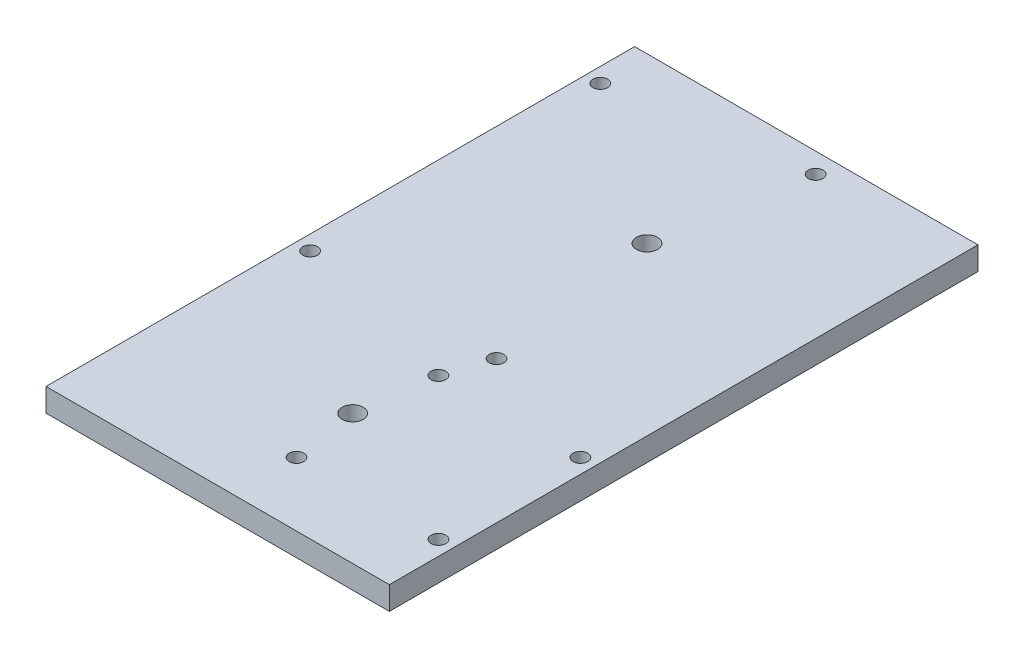
ISO-10303-21;
HEADER;
FILE_DESCRIPTION(('STEP AP214'),'2;1');
FILE_NAME('part.step','',(''),(''),'','','');
FILE_SCHEMA(('AUTOMOTIVE_DESIGN { 1 0 10303 214 1 1 1 1 }'));
ENDSEC;
DATA;
#1=APPLICATION_CONTEXT('core data for automotive mechanical design processes');
#2=APPLICATION_PROTOCOL_DEFINITION('international standard','automotive_design',2000,#1);
#3=PRODUCT_CONTEXT('',#1,'mechanical');
#4=PRODUCT('Part','Part','',(#3));
#5=PRODUCT_RELATED_PRODUCT_CATEGORY('part','',(#4));
#6=PRODUCT_DEFINITION_FORMATION('','',#4);
#7=PRODUCT_DEFINITION_CONTEXT('part definition',#1,'design');
#8=PRODUCT_DEFINITION('design','',#6,#7);
#9=PRODUCT_DEFINITION_SHAPE('','',#8);
#10=(LENGTH_UNIT() NAMED_UNIT(*) SI_UNIT(.MILLI.,.METRE.));
#11=(NAMED_UNIT(*) PLANE_ANGLE_UNIT() SI_UNIT($,.RADIAN.));
#12=(NAMED_UNIT(*) SI_UNIT($,.STERADIAN.) SOLID_ANGLE_UNIT());
#13=UNCERTAINTY_MEASURE_WITH_UNIT(LENGTH_MEASURE(1.E-05),#10,'distance_accuracy_value','');
#14=(GEOMETRIC_REPRESENTATION_CONTEXT(3) GLOBAL_UNCERTAINTY_ASSIGNED_CONTEXT((#13)) GLOBAL_UNIT_ASSIGNED_CONTEXT((#10,
#11,#12)) REPRESENTATION_CONTEXT('',''));
#15=CARTESIAN_POINT('',(0.,0.,0.));
#16=DIRECTION('',(0.,0.,1.));
#17=DIRECTION('',(1.,0.,0.));
#18=AXIS2_PLACEMENT_3D('',#15,#16,#17);
#19=CARTESIAN_POINT('',(0.,5.9944,0.));
#20=DIRECTION('',(-1.,0.,0.));
#21=DIRECTION('',(0.,0.,1.));
#22=AXIS2_PLACEMENT_3D('',#19,#20,#21);
#23=PLANE('',#22);
#24=DIRECTION('',(0.,0.,-1.));
#25=VECTOR('',#24,1.);
#26=CARTESIAN_POINT('',(0.,0.,0.));
#27=LINE('',#26,#25);
#28=CARTESIAN_POINT('',(0.,0.,0.));
#29=VERTEX_POINT('',#28);
#30=CARTESIAN_POINT('',(0.,0.,-152.4));
#31=VERTEX_POINT('',#30);
#32=EDGE_CURVE('E114',#29,#31,#27,.T.);
#33=ORIENTED_EDGE('',*,*,#32,.F.);
#34=DIRECTION('',(0.,-1.,0.));
#35=VECTOR('',#34,1.);
#36=CARTESIAN_POINT('',(0.,5.9944,0.));
#37=LINE('',#36,#35);
#38=CARTESIAN_POINT('',(0.,5.9944,0.));
#39=VERTEX_POINT('',#38);
#40=EDGE_CURVE('E11',#39,#29,#37,.T.);
#41=ORIENTED_EDGE('',*,*,#40,.F.);
#42=DIRECTION('',(0.,0.,-1.));
#43=VECTOR('',#42,1.);
#44=CARTESIAN_POINT('',(0.,5.9944,0.));
#45=LINE('',#44,#43);
#46=CARTESIAN_POINT('',(0.,5.9944,-152.4));
#47=VERTEX_POINT('',#46);
#48=EDGE_CURVE('E105',#39,#47,#45,.T.);
#49=ORIENTED_EDGE('',*,*,#48,.T.);
#50=DIRECTION('',(0.,-1.,0.));
#51=VECTOR('',#50,1.);
#52=CARTESIAN_POINT('',(0.,5.9944,-152.4));
#53=LINE('',#52,#51);
#54=EDGE_CURVE('E45',#47,#31,#53,.T.);
#55=ORIENTED_EDGE('',*,*,#54,.T.);
#56=EDGE_LOOP('',(#33,#41,#49,#55));
#57=FACE_BOUND('',#56,.T.);
#58=ADVANCED_FACE('F42',(#57),#23,.T.);
#59=CARTESIAN_POINT('',(0.,5.9944,0.));
#60=DIRECTION('',(0.,0.,-1.));
#61=DIRECTION('',(-1.,0.,0.));
#62=AXIS2_PLACEMENT_3D('',#59,#60,#61);
#63=PLANE('',#62);
#64=DIRECTION('',(1.,0.,0.));
#65=VECTOR('',#64,1.);
#66=CARTESIAN_POINT('',(0.,0.,0.));
#67=LINE('',#66,#65);
#68=CARTESIAN_POINT('',(88.9,0.,0.));
#69=VERTEX_POINT('',#68);
#70=EDGE_CURVE('E108',#29,#69,#67,.T.);
#71=ORIENTED_EDGE('',*,*,#70,.T.);
#72=DIRECTION('',(0.,-1.,0.));
#73=VECTOR('',#72,1.);
#74=CARTESIAN_POINT('',(88.9,5.9944,0.));
#75=LINE('',#74,#73);
#76=CARTESIAN_POINT('',(88.9,5.9944,0.));
#77=VERTEX_POINT('',#76);
#78=EDGE_CURVE('E52',#77,#69,#75,.T.);
#79=ORIENTED_EDGE('',*,*,#78,.F.);
#80=DIRECTION('',(1.,0.,0.));
#81=VECTOR('',#80,1.);
#82=CARTESIAN_POINT('',(0.,5.9944,0.));
#83=LINE('',#82,#81);
#84=EDGE_CURVE('E100',#39,#77,#83,.T.);
#85=ORIENTED_EDGE('',*,*,#84,.F.);
#86=ORIENTED_EDGE('',*,*,#40,.T.);
#87=EDGE_LOOP('',(#71,#79,#85,#86));
#88=FACE_BOUND('',#87,.T.);
#89=ADVANCED_FACE('F130',(#88),#63,.F.);
#90=CARTESIAN_POINT('',(88.9,5.9944,-152.4));
#91=DIRECTION('',(1.,0.,0.));
#92=DIRECTION('',(0.,0.,-1.));
#93=AXIS2_PLACEMENT_3D('',#90,#91,#92);
#94=PLANE('',#93);
#95=DIRECTION('',(0.,0.,1.));
#96=VECTOR('',#95,1.);
#97=CARTESIAN_POINT('',(88.9,0.,-152.4));
#98=LINE('',#97,#96);
#99=CARTESIAN_POINT('',(88.9,0.,-152.4));
#100=VERTEX_POINT('',#99);
#101=EDGE_CURVE('E93',#100,#69,#98,.T.);
#102=ORIENTED_EDGE('',*,*,#101,.F.);
#103=DIRECTION('',(0.,-1.,0.));
#104=VECTOR('',#103,1.);
#105=CARTESIAN_POINT('',(88.9,5.9944,-152.4));
#106=LINE('',#105,#104);
#107=CARTESIAN_POINT('',(88.9,5.9944,-152.4));
#108=VERTEX_POINT('',#107);
#109=EDGE_CURVE('E88',#108,#100,#106,.T.);
#110=ORIENTED_EDGE('',*,*,#109,.F.);
#111=DIRECTION('',(0.,0.,1.));
#112=VECTOR('',#111,1.);
#113=CARTESIAN_POINT('',(88.9,5.9944,-152.4));
#114=LINE('',#113,#112);
#115=EDGE_CURVE('E91',#108,#77,#114,.T.);
#116=ORIENTED_EDGE('',*,*,#115,.T.);
#117=ORIENTED_EDGE('',*,*,#78,.T.);
#118=EDGE_LOOP('',(#102,#110,#116,#117));
#119=FACE_BOUND('',#118,.T.);
#120=ADVANCED_FACE('F90',(#119),#94,.T.);
#121=CARTESIAN_POINT('',(0.,5.9944,-152.4));
#122=DIRECTION('',(0.,0.,-1.));
#123=DIRECTION('',(-1.,0.,0.));
#124=AXIS2_PLACEMENT_3D('',#121,#122,#123);
#125=PLANE('',#124);
#126=DIRECTION('',(1.,0.,0.));
#127=VECTOR('',#126,1.);
#128=CARTESIAN_POINT('',(0.,0.,-152.4));
#129=LINE('',#128,#127);
#130=EDGE_CURVE('E118',#31,#100,#129,.T.);
#131=ORIENTED_EDGE('',*,*,#130,.F.);
#132=ORIENTED_EDGE('',*,*,#54,.F.);
#133=DIRECTION('',(1.,0.,0.));
#134=VECTOR('',#133,1.);
#135=CARTESIAN_POINT('',(0.,5.9944,-152.4));
#136=LINE('',#135,#134);
#137=EDGE_CURVE('E99',#47,#108,#136,.T.);
#138=ORIENTED_EDGE('',*,*,#137,.T.);
#139=ORIENTED_EDGE('',*,*,#109,.T.);
#140=EDGE_LOOP('',(#131,#132,#138,#139));
#141=FACE_BOUND('',#140,.T.);
#142=ADVANCED_FACE('F103',(#141),#125,.T.);
#143=CARTESIAN_POINT('',(0.,5.9944,0.));
#144=DIRECTION('',(0.,-1.,0.));
#145=DIRECTION('',(0.,0.,-1.));
#146=AXIS2_PLACEMENT_3D('',#143,#144,#145);
#147=PLANE('',#146);
#148=CARTESIAN_POINT('',(45.72,5.9944,-109.871331367004));
#149=DIRECTION('',(0.,1.,0.));
#150=DIRECTION('',(0.,0.,1.));
#151=AXIS2_PLACEMENT_3D('',#148,#149,#150);
#152=CIRCLE('',#151,2.7305);
#153=CARTESIAN_POINT('',(45.72,5.9944,-107.140831367004));
#154=VERTEX_POINT('',#153);
#155=EDGE_CURVE('E198',#154,#154,#152,.T.);
#156=ORIENTED_EDGE('',*,*,#155,.F.);
#157=EDGE_LOOP('',(#156));
#158=FACE_BOUND('',#157,.T.);
#159=CARTESIAN_POINT('',(45.72,5.9944,-33.6713313670038));
#160=DIRECTION('',(0.,1.,0.));
#161=DIRECTION('',(0.,0.,1.));
#162=AXIS2_PLACEMENT_3D('',#159,#160,#161);
#163=CIRCLE('',#162,2.7305);
#164=CARTESIAN_POINT('',(45.72,5.9944,-30.9408313670038));
#165=VERTEX_POINT('',#164);
#166=EDGE_CURVE('E200',#165,#165,#163,.T.);
#167=ORIENTED_EDGE('',*,*,#166,.F.);
#168=EDGE_LOOP('',(#167));
#169=FACE_BOUND('',#168,.T.);
#170=CARTESIAN_POINT('',(48.3362,5.9944,-16.51));
#171=DIRECTION('',(0.,-1.,0.));
#172=DIRECTION('',(0.,0.,-1.));
#173=AXIS2_PLACEMENT_3D('',#170,#171,#172);
#174=CIRCLE('',#173,1.905);
#175=CARTESIAN_POINT('',(48.3362,5.9944,-18.415));
#176=VERTEX_POINT('',#175);
#177=EDGE_CURVE('E119',#176,#176,#174,.T.);
#178=ORIENTED_EDGE('',*,*,#177,.T.);
#179=EDGE_LOOP('',(#178));
#180=FACE_BOUND('',#179,.T.);
#181=CARTESIAN_POINT('',(3.81,5.9944,-64.5668));
#182=DIRECTION('',(0.,-1.,0.));
#183=DIRECTION('',(0.,0.,-1.));
#184=AXIS2_PLACEMENT_3D('',#181,#182,#183);
#185=CIRCLE('',#184,1.90500000000001);
#186=CARTESIAN_POINT('',(3.81,5.9944,-66.4718));
#187=VERTEX_POINT('',#186);
#188=EDGE_CURVE('E268',#187,#187,#185,.T.);
#189=ORIENTED_EDGE('',*,*,#188,.T.);
#190=EDGE_LOOP('',(#189));
#191=FACE_BOUND('',#190,.T.);
#192=CARTESIAN_POINT('',(52.07,5.9944,-64.5668));
#193=DIRECTION('',(0.,-1.,0.));
#194=DIRECTION('',(0.,0.,-1.));
#195=AXIS2_PLACEMENT_3D('',#192,#193,#194);
#196=CIRCLE('',#195,1.90500000000001);
#197=CARTESIAN_POINT('',(52.07,5.9944,-66.4718));
#198=VERTEX_POINT('',#197);
#199=EDGE_CURVE('E264',#198,#198,#196,.T.);
#200=ORIENTED_EDGE('',*,*,#199,.T.);
#201=EDGE_LOOP('',(#200));
#202=FACE_BOUND('',#201,.T.);
#203=CARTESIAN_POINT('',(52.07,5.9944,-147.193));
#204=DIRECTION('',(0.,-1.,0.));
#205=DIRECTION('',(0.,0.,-1.));
#206=AXIS2_PLACEMENT_3D('',#203,#204,#205);
#207=CIRCLE('',#206,1.905);
#208=CARTESIAN_POINT('',(52.07,5.9944,-149.098));
#209=VERTEX_POINT('',#208);
#210=EDGE_CURVE('E260',#209,#209,#207,.T.);
#211=ORIENTED_EDGE('',*,*,#210,.T.);
#212=EDGE_LOOP('',(#211));
#213=FACE_BOUND('',#212,.T.);
#214=CARTESIAN_POINT('',(48.3362,5.9944,-53.2638));
#215=DIRECTION('',(0.,-1.,0.));
#216=DIRECTION('',(0.,0.,-1.));
#217=AXIS2_PLACEMENT_3D('',#214,#215,#216);
#218=CIRCLE('',#217,1.905);
#219=CARTESIAN_POINT('',(48.3362,5.9944,-55.1688));
#220=VERTEX_POINT('',#219);
#221=EDGE_CURVE('E256',#220,#220,#218,.T.);
#222=ORIENTED_EDGE('',*,*,#221,.T.);
#223=EDGE_LOOP('',(#222));
#224=FACE_BOUND('',#223,.T.);
#225=CARTESIAN_POINT('',(85.09,5.9944,-53.2638));
#226=DIRECTION('',(0.,-1.,0.));
#227=DIRECTION('',(0.,0.,-1.));
#228=AXIS2_PLACEMENT_3D('',#225,#226,#227);
#229=CIRCLE('',#228,1.90500000000001);
#230=CARTESIAN_POINT('',(85.09,5.9944,-55.1688));
#231=VERTEX_POINT('',#230);
#232=EDGE_CURVE('E252',#231,#231,#229,.T.);
#233=ORIENTED_EDGE('',*,*,#232,.T.);
#234=EDGE_LOOP('',(#233));
#235=FACE_BOUND('',#234,.T.);
#236=CARTESIAN_POINT('',(85.09,5.9944,-16.51));
#237=DIRECTION('',(0.,-1.,0.));
#238=DIRECTION('',(0.,0.,-1.));
#239=AXIS2_PLACEMENT_3D('',#236,#237,#238);
#240=CIRCLE('',#239,1.90500000000001);
#241=CARTESIAN_POINT('',(85.09,5.9944,-18.415));
#242=VERTEX_POINT('',#241);
#243=EDGE_CURVE('E248',#242,#242,#240,.T.);
#244=ORIENTED_EDGE('',*,*,#243,.T.);
#245=EDGE_LOOP('',(#244));
#246=FACE_BOUND('',#245,.T.);
#247=CARTESIAN_POINT('',(3.81,5.9944,-139.7));
#248=DIRECTION('',(0.,-1.,0.));
#249=DIRECTION('',(0.,0.,-1.));
#250=AXIS2_PLACEMENT_3D('',#247,#248,#249);
#251=CIRCLE('',#250,1.90499999999999);
#252=CARTESIAN_POINT('',(3.81,5.9944,-141.605));
#253=VERTEX_POINT('',#252);
#254=EDGE_CURVE('E244',#253,#253,#251,.T.);
#255=ORIENTED_EDGE('',*,*,#254,.T.);
#256=EDGE_LOOP('',(#255));
#257=FACE_BOUND('',#256,.T.);
#258=ORIENTED_EDGE('',*,*,#48,.F.);
#259=ORIENTED_EDGE('',*,*,#84,.T.);
#260=ORIENTED_EDGE('',*,*,#115,.F.);
#261=ORIENTED_EDGE('',*,*,#137,.F.);
#262=EDGE_LOOP('',(#258,#259,#260,#261));
#263=FACE_BOUND('',#262,.T.);
#264=ADVANCED_FACE('F98',(#158,#169,#180,#191,#202,#213,#224,#235,#246,#257,#263),#147,.F.);
#265=CARTESIAN_POINT('',(0.,0.,0.));
#266=DIRECTION('',(0.,-1.,0.));
#267=DIRECTION('',(0.,0.,-1.));
#268=AXIS2_PLACEMENT_3D('',#265,#266,#267);
#269=PLANE('',#268);
#270=CARTESIAN_POINT('',(45.72,0.,-109.871331367004));
#271=DIRECTION('',(0.,1.,0.));
#272=DIRECTION('',(0.,0.,1.));
#273=AXIS2_PLACEMENT_3D('',#270,#271,#272);
#274=CIRCLE('',#273,2.7305);
#275=CARTESIAN_POINT('',(45.72,0.,-107.140831367004));
#276=VERTEX_POINT('',#275);
#277=EDGE_CURVE('E196',#276,#276,#274,.T.);
#278=ORIENTED_EDGE('',*,*,#277,.T.);
#279=EDGE_LOOP('',(#278));
#280=FACE_BOUND('',#279,.T.);
#281=CARTESIAN_POINT('',(45.72,0.,-33.6713313670038));
#282=DIRECTION('',(0.,1.,0.));
#283=DIRECTION('',(0.,0.,1.));
#284=AXIS2_PLACEMENT_3D('',#281,#282,#283);
#285=CIRCLE('',#284,2.7305);
#286=CARTESIAN_POINT('',(45.72,0.,-30.9408313670038));
#287=VERTEX_POINT('',#286);
#288=EDGE_CURVE('E207',#287,#287,#285,.T.);
#289=ORIENTED_EDGE('',*,*,#288,.T.);
#290=EDGE_LOOP('',(#289));
#291=FACE_BOUND('',#290,.T.);
#292=CARTESIAN_POINT('',(48.3362,0.,-16.51));
#293=DIRECTION('',(0.,1.,0.));
#294=DIRECTION('',(0.,0.,1.));
#295=AXIS2_PLACEMENT_3D('',#292,#293,#294);
#296=CIRCLE('',#295,1.905);
#297=CARTESIAN_POINT('',(48.3362,0.,-14.605));
#298=VERTEX_POINT('',#297);
#299=EDGE_CURVE('E217',#298,#298,#296,.T.);
#300=ORIENTED_EDGE('',*,*,#299,.T.);
#301=EDGE_LOOP('',(#300));
#302=FACE_BOUND('',#301,.T.);
#303=CARTESIAN_POINT('',(3.81,0.,-64.5668));
#304=DIRECTION('',(0.,1.,0.));
#305=DIRECTION('',(0.,0.,1.));
#306=AXIS2_PLACEMENT_3D('',#303,#304,#305);
#307=CIRCLE('',#306,1.90500000000001);
#308=CARTESIAN_POINT('',(3.81,0.,-62.6618));
#309=VERTEX_POINT('',#308);
#310=EDGE_CURVE('E225',#309,#309,#307,.T.);
#311=ORIENTED_EDGE('',*,*,#310,.T.);
#312=EDGE_LOOP('',(#311));
#313=FACE_BOUND('',#312,.T.);
#314=CARTESIAN_POINT('',(52.07,0.,-64.5668));
#315=DIRECTION('',(0.,1.,0.));
#316=DIRECTION('',(0.,0.,1.));
#317=AXIS2_PLACEMENT_3D('',#314,#315,#316);
#318=CIRCLE('',#317,1.90500000000001);
#319=CARTESIAN_POINT('',(52.07,0.,-62.6618));
#320=VERTEX_POINT('',#319);
#321=EDGE_CURVE('E229',#320,#320,#318,.T.);
#322=ORIENTED_EDGE('',*,*,#321,.T.);
#323=EDGE_LOOP('',(#322));
#324=FACE_BOUND('',#323,.T.);
#325=CARTESIAN_POINT('',(52.07,0.,-147.193));
#326=DIRECTION('',(0.,1.,0.));
#327=DIRECTION('',(0.,0.,1.));
#328=AXIS2_PLACEMENT_3D('',#325,#326,#327);
#329=CIRCLE('',#328,1.905);
#330=CARTESIAN_POINT('',(52.07,0.,-145.288));
#331=VERTEX_POINT('',#330);
#332=EDGE_CURVE('E233',#331,#331,#329,.T.);
#333=ORIENTED_EDGE('',*,*,#332,.T.);
#334=EDGE_LOOP('',(#333));
#335=FACE_BOUND('',#334,.T.);
#336=CARTESIAN_POINT('',(48.3362,0.,-53.2638));
#337=DIRECTION('',(0.,1.,0.));
#338=DIRECTION('',(0.,0.,1.));
#339=AXIS2_PLACEMENT_3D('',#336,#337,#338);
#340=CIRCLE('',#339,1.905);
#341=CARTESIAN_POINT('',(48.3362,0.,-51.3588));
#342=VERTEX_POINT('',#341);
#343=EDGE_CURVE('E213',#342,#342,#340,.T.);
#344=ORIENTED_EDGE('',*,*,#343,.T.);
#345=EDGE_LOOP('',(#344));
#346=FACE_BOUND('',#345,.T.);
#347=CARTESIAN_POINT('',(85.09,0.,-53.2638));
#348=DIRECTION('',(0.,1.,0.));
#349=DIRECTION('',(0.,0.,1.));
#350=AXIS2_PLACEMENT_3D('',#347,#348,#349);
#351=CIRCLE('',#350,1.90500000000001);
#352=CARTESIAN_POINT('',(85.09,0.,-51.3588));
#353=VERTEX_POINT('',#352);
#354=EDGE_CURVE('E218',#353,#353,#351,.T.);
#355=ORIENTED_EDGE('',*,*,#354,.T.);
#356=EDGE_LOOP('',(#355));
#357=FACE_BOUND('',#356,.T.);
#358=CARTESIAN_POINT('',(85.09,0.,-16.51));
#359=DIRECTION('',(0.,1.,0.));
#360=DIRECTION('',(0.,0.,1.));
#361=AXIS2_PLACEMENT_3D('',#358,#359,#360);
#362=CIRCLE('',#361,1.90500000000001);
#363=CARTESIAN_POINT('',(85.09,0.,-14.605));
#364=VERTEX_POINT('',#363);
#365=EDGE_CURVE('E204',#364,#364,#362,.T.);
#366=ORIENTED_EDGE('',*,*,#365,.T.);
#367=EDGE_LOOP('',(#366));
#368=FACE_BOUND('',#367,.T.);
#369=CARTESIAN_POINT('',(3.81,0.,-139.7));
#370=DIRECTION('',(0.,1.,0.));
#371=DIRECTION('',(0.,0.,1.));
#372=AXIS2_PLACEMENT_3D('',#369,#370,#371);
#373=CIRCLE('',#372,1.90499999999999);
#374=CARTESIAN_POINT('',(3.81,0.,-137.795));
#375=VERTEX_POINT('',#374);
#376=EDGE_CURVE('E237',#375,#375,#373,.T.);
#377=ORIENTED_EDGE('',*,*,#376,.T.);
#378=EDGE_LOOP('',(#377));
#379=FACE_BOUND('',#378,.T.);
#380=ORIENTED_EDGE('',*,*,#32,.T.);
#381=ORIENTED_EDGE('',*,*,#130,.T.);
#382=ORIENTED_EDGE('',*,*,#101,.T.);
#383=ORIENTED_EDGE('',*,*,#70,.F.);
#384=EDGE_LOOP('',(#380,#381,#382,#383));
#385=FACE_BOUND('',#384,.T.);
#386=ADVANCED_FACE('F129',(#280,#291,#302,#313,#324,#335,#346,#357,#368,#379,#385),#269,.T.);
#387=CARTESIAN_POINT('',(3.81,0.,-139.7));
#388=DIRECTION('',(0.,1.,0.));
#389=DIRECTION('',(0.,0.,1.));
#390=AXIS2_PLACEMENT_3D('',#387,#388,#389);
#391=CYLINDRICAL_SURFACE('',#390,1.90499999999999);
#392=ORIENTED_EDGE('',*,*,#376,.F.);
#393=EDGE_LOOP('',(#392));
#394=FACE_BOUND('',#393,.T.);
#395=ORIENTED_EDGE('',*,*,#254,.F.);
#396=EDGE_LOOP('',(#395));
#397=FACE_BOUND('',#396,.T.);
#398=ADVANCED_FACE('F148',(#394,#397),#391,.F.);
#399=CARTESIAN_POINT('',(85.09,0.,-16.51));
#400=DIRECTION('',(0.,1.,0.));
#401=DIRECTION('',(0.,0.,1.));
#402=AXIS2_PLACEMENT_3D('',#399,#400,#401);
#403=CYLINDRICAL_SURFACE('',#402,1.90500000000001);
#404=ORIENTED_EDGE('',*,*,#365,.F.);
#405=EDGE_LOOP('',(#404));
#406=FACE_BOUND('',#405,.T.);
#407=ORIENTED_EDGE('',*,*,#243,.F.);
#408=EDGE_LOOP('',(#407));
#409=FACE_BOUND('',#408,.T.);
#410=ADVANCED_FACE('F155',(#406,#409),#403,.F.);
#411=CARTESIAN_POINT('',(85.09,0.,-53.2638));
#412=DIRECTION('',(0.,1.,0.));
#413=DIRECTION('',(0.,0.,1.));
#414=AXIS2_PLACEMENT_3D('',#411,#412,#413);
#415=CYLINDRICAL_SURFACE('',#414,1.90500000000001);
#416=ORIENTED_EDGE('',*,*,#354,.F.);
#417=EDGE_LOOP('',(#416));
#418=FACE_BOUND('',#417,.T.);
#419=ORIENTED_EDGE('',*,*,#232,.F.);
#420=EDGE_LOOP('',(#419));
#421=FACE_BOUND('',#420,.T.);
#422=ADVANCED_FACE('F177',(#418,#421),#415,.F.);
#423=CARTESIAN_POINT('',(48.3362,0.,-53.2638));
#424=DIRECTION('',(0.,1.,0.));
#425=DIRECTION('',(0.,0.,1.));
#426=AXIS2_PLACEMENT_3D('',#423,#424,#425);
#427=CYLINDRICAL_SURFACE('',#426,1.905);
#428=ORIENTED_EDGE('',*,*,#343,.F.);
#429=EDGE_LOOP('',(#428));
#430=FACE_BOUND('',#429,.T.);
#431=ORIENTED_EDGE('',*,*,#221,.F.);
#432=EDGE_LOOP('',(#431));
#433=FACE_BOUND('',#432,.T.);
#434=ADVANCED_FACE('F165',(#430,#433),#427,.F.);
#435=CARTESIAN_POINT('',(52.07,0.,-147.193));
#436=DIRECTION('',(0.,1.,0.));
#437=DIRECTION('',(0.,0.,1.));
#438=AXIS2_PLACEMENT_3D('',#435,#436,#437);
#439=CYLINDRICAL_SURFACE('',#438,1.905);
#440=ORIENTED_EDGE('',*,*,#332,.F.);
#441=EDGE_LOOP('',(#440));
#442=FACE_BOUND('',#441,.T.);
#443=ORIENTED_EDGE('',*,*,#210,.F.);
#444=EDGE_LOOP('',(#443));
#445=FACE_BOUND('',#444,.T.);
#446=ADVANCED_FACE('F161',(#442,#445),#439,.F.);
#447=CARTESIAN_POINT('',(52.07,0.,-64.5668));
#448=DIRECTION('',(0.,1.,0.));
#449=DIRECTION('',(0.,0.,1.));
#450=AXIS2_PLACEMENT_3D('',#447,#448,#449);
#451=CYLINDRICAL_SURFACE('',#450,1.90500000000001);
#452=ORIENTED_EDGE('',*,*,#321,.F.);
#453=EDGE_LOOP('',(#452));
#454=FACE_BOUND('',#453,.T.);
#455=ORIENTED_EDGE('',*,*,#199,.F.);
#456=EDGE_LOOP('',(#455));
#457=FACE_BOUND('',#456,.T.);
#458=ADVANCED_FACE('F157',(#454,#457),#451,.F.);
#459=CARTESIAN_POINT('',(3.81,0.,-64.5668));
#460=DIRECTION('',(0.,1.,0.));
#461=DIRECTION('',(0.,0.,1.));
#462=AXIS2_PLACEMENT_3D('',#459,#460,#461);
#463=CYLINDRICAL_SURFACE('',#462,1.90500000000001);
#464=ORIENTED_EDGE('',*,*,#310,.F.);
#465=EDGE_LOOP('',(#464));
#466=FACE_BOUND('',#465,.T.);
#467=ORIENTED_EDGE('',*,*,#188,.F.);
#468=EDGE_LOOP('',(#467));
#469=FACE_BOUND('',#468,.T.);
#470=ADVANCED_FACE('F160',(#466,#469),#463,.F.);
#471=CARTESIAN_POINT('',(48.3362,0.,-16.51));
#472=DIRECTION('',(0.,1.,0.));
#473=DIRECTION('',(0.,0.,1.));
#474=AXIS2_PLACEMENT_3D('',#471,#472,#473);
#475=CYLINDRICAL_SURFACE('',#474,1.905);
#476=ORIENTED_EDGE('',*,*,#299,.F.);
#477=EDGE_LOOP('',(#476));
#478=FACE_BOUND('',#477,.T.);
#479=ORIENTED_EDGE('',*,*,#177,.F.);
#480=EDGE_LOOP('',(#479));
#481=FACE_BOUND('',#480,.T.);
#482=ADVANCED_FACE('F167',(#478,#481),#475,.F.);
#483=CARTESIAN_POINT('',(45.72,0.,-33.6713313670038));
#484=DIRECTION('',(0.,1.,0.));
#485=DIRECTION('',(0.,0.,1.));
#486=AXIS2_PLACEMENT_3D('',#483,#484,#485);
#487=CYLINDRICAL_SURFACE('',#486,2.7305);
#488=ORIENTED_EDGE('',*,*,#288,.F.);
#489=EDGE_LOOP('',(#488));
#490=FACE_BOUND('',#489,.T.);
#491=ORIENTED_EDGE('',*,*,#166,.T.);
#492=EDGE_LOOP('',(#491));
#493=FACE_BOUND('',#492,.T.);
#494=ADVANCED_FACE('F170',(#490,#493),#487,.F.);
#495=CARTESIAN_POINT('',(45.72,0.,-109.871331367004));
#496=DIRECTION('',(0.,1.,0.));
#497=DIRECTION('',(0.,0.,1.));
#498=AXIS2_PLACEMENT_3D('',#495,#496,#497);
#499=CYLINDRICAL_SURFACE('',#498,2.7305);
#500=ORIENTED_EDGE('',*,*,#277,.F.);
#501=EDGE_LOOP('',(#500));
#502=FACE_BOUND('',#501,.T.);
#503=ORIENTED_EDGE('',*,*,#155,.T.);
#504=EDGE_LOOP('',(#503));
#505=FACE_BOUND('',#504,.T.);
#506=ADVANCED_FACE('F187',(#502,#505),#499,.F.);
#507=CLOSED_SHELL('',(#58,#89,#120,#142,#264,#386,#398,#410,#422,#434,#446,#458,#470,#482,#494,#506));
#508=MANIFOLD_SOLID_BREP('B2',#507);
#509=ADVANCED_BREP_SHAPE_REPRESENTATION('',(#18,#508),#14);
#510=SHAPE_DEFINITION_REPRESENTATION(#9,#509);
ENDSEC;
END-ISO-10303-21;
